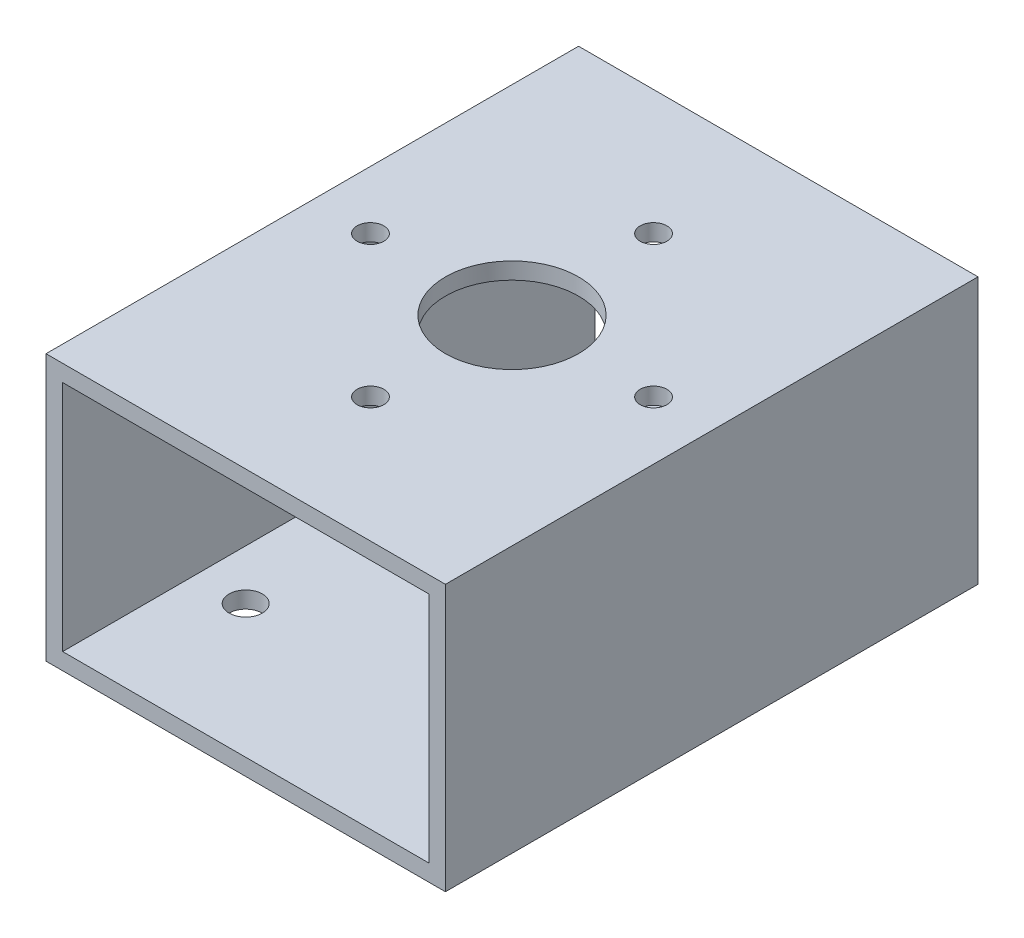
ISO-10303-21;
HEADER;
FILE_DESCRIPTION(('STEP AP214'),'2;1');
FILE_NAME('part.step','',(''),(''),'','','');
FILE_SCHEMA(('AUTOMOTIVE_DESIGN { 1 0 10303 214 1 1 1 1 }'));
ENDSEC;
DATA;
#1=APPLICATION_CONTEXT('core data for automotive mechanical design processes');
#2=APPLICATION_PROTOCOL_DEFINITION('international standard','automotive_design',2000,#1);
#3=PRODUCT_CONTEXT('',#1,'mechanical');
#4=PRODUCT('Part','Part','',(#3));
#5=PRODUCT_RELATED_PRODUCT_CATEGORY('part','',(#4));
#6=PRODUCT_DEFINITION_FORMATION('','',#4);
#7=PRODUCT_DEFINITION_CONTEXT('part definition',#1,'design');
#8=PRODUCT_DEFINITION('design','',#6,#7);
#9=PRODUCT_DEFINITION_SHAPE('','',#8);
#10=(LENGTH_UNIT() NAMED_UNIT(*) SI_UNIT(.MILLI.,.METRE.));
#11=(NAMED_UNIT(*) PLANE_ANGLE_UNIT() SI_UNIT($,.RADIAN.));
#12=(NAMED_UNIT(*) SI_UNIT($,.STERADIAN.) SOLID_ANGLE_UNIT());
#13=UNCERTAINTY_MEASURE_WITH_UNIT(LENGTH_MEASURE(1.E-05),#10,'distance_accuracy_value','');
#14=(GEOMETRIC_REPRESENTATION_CONTEXT(3) GLOBAL_UNCERTAINTY_ASSIGNED_CONTEXT((#13)) GLOBAL_UNIT_ASSIGNED_CONTEXT((#10,
#11,#12)) REPRESENTATION_CONTEXT('',''));
#15=CARTESIAN_POINT('',(0.,0.,0.));
#16=DIRECTION('',(0.,0.,1.));
#17=DIRECTION('',(1.,0.,0.));
#18=AXIS2_PLACEMENT_3D('',#15,#16,#17);
#19=CARTESIAN_POINT('',(-34.925,22.225,101.6));
#20=DIRECTION('',(0.,-1.,0.));
#21=DIRECTION('',(1.,0.,0.));
#22=AXIS2_PLACEMENT_3D('',#19,#20,#21);
#23=PLANE('',#22);
#24=CARTESIAN_POINT('',(0.,22.225,50.8));
#25=DIRECTION('',(0.,-1.,0.));
#26=DIRECTION('',(1.,0.,0.));
#27=AXIS2_PLACEMENT_3D('',#24,#25,#26);
#28=CIRCLE('',#27,12.7);
#29=CARTESIAN_POINT('',(12.7,22.225,50.8));
#30=VERTEX_POINT('',#29);
#31=EDGE_CURVE('E311',#30,#30,#28,.F.);
#32=ORIENTED_EDGE('',*,*,#31,.T.);
#33=EDGE_LOOP('',(#32));
#34=FACE_BOUND('',#33,.T.);
#35=DIRECTION('',(-1.,0.,0.));
#36=VECTOR('',#35,1.);
#37=CARTESIAN_POINT('',(-34.925,22.225,0.));
#38=LINE('',#37,#36);
#39=CARTESIAN_POINT('',(34.925,22.225,0.));
#40=VERTEX_POINT('',#39);
#41=CARTESIAN_POINT('',(-34.925,22.225,0.));
#42=VERTEX_POINT('',#41);
#43=EDGE_CURVE('E107',#40,#42,#38,.T.);
#44=ORIENTED_EDGE('',*,*,#43,.F.);
#45=DIRECTION('',(0.,0.,-1.));
#46=VECTOR('',#45,1.);
#47=CARTESIAN_POINT('',(34.925,22.225,101.6));
#48=LINE('',#47,#46);
#49=CARTESIAN_POINT('',(34.925,22.225,101.6));
#50=VERTEX_POINT('',#49);
#51=EDGE_CURVE('E48',#50,#40,#48,.T.);
#52=ORIENTED_EDGE('',*,*,#51,.F.);
#53=DIRECTION('',(-1.,0.,0.));
#54=VECTOR('',#53,1.);
#55=CARTESIAN_POINT('',(-34.925,22.225,101.6));
#56=LINE('',#55,#54);
#57=CARTESIAN_POINT('',(-34.925,22.225,101.6));
#58=VERTEX_POINT('',#57);
#59=EDGE_CURVE('E121',#50,#58,#56,.T.);
#60=ORIENTED_EDGE('',*,*,#59,.T.);
#61=DIRECTION('',(0.,0.,-1.));
#62=VECTOR('',#61,1.);
#63=CARTESIAN_POINT('',(-34.925,22.225,101.6));
#64=LINE('',#63,#62);
#65=EDGE_CURVE('E102',#58,#42,#64,.T.);
#66=ORIENTED_EDGE('',*,*,#65,.T.);
#67=EDGE_LOOP('',(#44,#52,#60,#66));
#68=FACE_BOUND('',#67,.T.);
#69=CARTESIAN_POINT('',(1.53103951828523E-12,22.225,77.8002));
#70=DIRECTION('',(0.,-1.,0.));
#71=DIRECTION('',(1.,0.,0.));
#72=AXIS2_PLACEMENT_3D('',#69,#70,#71);
#73=CIRCLE('',#72,2.5527);
#74=CARTESIAN_POINT('',(2.55270000000153,22.225,77.8002));
#75=VERTEX_POINT('',#74);
#76=EDGE_CURVE('E127',#75,#75,#73,.F.);
#77=ORIENTED_EDGE('',*,*,#76,.T.);
#78=EDGE_LOOP('',(#77));
#79=FACE_BOUND('',#78,.T.);
#80=CARTESIAN_POINT('',(27.0002000000008,22.225,50.7999999999992));
#81=DIRECTION('',(0.,-1.,0.));
#82=DIRECTION('',(1.,0.,0.));
#83=AXIS2_PLACEMENT_3D('',#80,#81,#82);
#84=CIRCLE('',#83,2.5527);
#85=CARTESIAN_POINT('',(29.5529000000008,22.225,50.7999999999992));
#86=VERTEX_POINT('',#85);
#87=EDGE_CURVE('E257',#86,#86,#84,.F.);
#88=ORIENTED_EDGE('',*,*,#87,.T.);
#89=EDGE_LOOP('',(#88));
#90=FACE_BOUND('',#89,.T.);
#91=CARTESIAN_POINT('',(0.,22.225,23.7998));
#92=DIRECTION('',(0.,-1.,0.));
#93=DIRECTION('',(1.,0.,0.));
#94=AXIS2_PLACEMENT_3D('',#91,#92,#93);
#95=CIRCLE('',#94,2.5527);
#96=CARTESIAN_POINT('',(2.5527,22.225,23.7998));
#97=VERTEX_POINT('',#96);
#98=EDGE_CURVE('E251',#97,#97,#95,.F.);
#99=ORIENTED_EDGE('',*,*,#98,.T.);
#100=EDGE_LOOP('',(#99));
#101=FACE_BOUND('',#100,.T.);
#102=CARTESIAN_POINT('',(-27.0001999999992,22.225,50.8000000000008));
#103=DIRECTION('',(0.,-1.,0.));
#104=DIRECTION('',(1.,0.,0.));
#105=AXIS2_PLACEMENT_3D('',#102,#103,#104);
#106=CIRCLE('',#105,2.5527);
#107=CARTESIAN_POINT('',(-24.4474999999992,22.225,50.8000000000008));
#108=VERTEX_POINT('',#107);
#109=EDGE_CURVE('E245',#108,#108,#106,.F.);
#110=ORIENTED_EDGE('',*,*,#109,.T.);
#111=EDGE_LOOP('',(#110));
#112=FACE_BOUND('',#111,.T.);
#113=ADVANCED_FACE('F33',(#34,#68,#79,#90,#101,#112),#23,.T.);
#114=CARTESIAN_POINT('',(0.,0.,101.6));
#115=DIRECTION('',(0.,0.,-1.));
#116=DIRECTION('',(-1.,0.,0.));
#117=AXIS2_PLACEMENT_3D('',#114,#115,#116);
#118=PLANE('',#117);
#119=DIRECTION('',(0.,1.,0.));
#120=VECTOR('',#119,1.);
#121=CARTESIAN_POINT('',(38.1,-25.4,101.6));
#122=LINE('',#121,#120);
#123=CARTESIAN_POINT('',(38.1,-25.4,101.6));
#124=VERTEX_POINT('',#123);
#125=CARTESIAN_POINT('',(38.1,25.4,101.6));
#126=VERTEX_POINT('',#125);
#127=EDGE_CURVE('E137',#124,#126,#122,.T.);
#128=ORIENTED_EDGE('',*,*,#127,.T.);
#129=DIRECTION('',(-1.,0.,0.));
#130=VECTOR('',#129,1.);
#131=CARTESIAN_POINT('',(-38.1,25.4,101.6));
#132=LINE('',#131,#130);
#133=CARTESIAN_POINT('',(-38.1,25.4,101.6));
#134=VERTEX_POINT('',#133);
#135=EDGE_CURVE('E140',#126,#134,#132,.T.);
#136=ORIENTED_EDGE('',*,*,#135,.T.);
#137=DIRECTION('',(0.,-1.,0.));
#138=VECTOR('',#137,1.);
#139=CARTESIAN_POINT('',(-38.1,-25.4,101.6));
#140=LINE('',#139,#138);
#141=CARTESIAN_POINT('',(-38.1,-25.4,101.6));
#142=VERTEX_POINT('',#141);
#143=EDGE_CURVE('E143',#134,#142,#140,.T.);
#144=ORIENTED_EDGE('',*,*,#143,.T.);
#145=DIRECTION('',(1.,0.,0.));
#146=VECTOR('',#145,1.);
#147=CARTESIAN_POINT('',(-38.1,-25.4,101.6));
#148=LINE('',#147,#146);
#149=EDGE_CURVE('E145',#142,#124,#148,.T.);
#150=ORIENTED_EDGE('',*,*,#149,.T.);
#151=EDGE_LOOP('',(#128,#136,#144,#150));
#152=FACE_BOUND('',#151,.T.);
#153=DIRECTION('',(0.,-1.,0.));
#154=VECTOR('',#153,1.);
#155=CARTESIAN_POINT('',(-34.925,-22.225,101.6));
#156=LINE('',#155,#154);
#157=CARTESIAN_POINT('',(-34.925,-22.225,101.6));
#158=VERTEX_POINT('',#157);
#159=EDGE_CURVE('E98',#58,#158,#156,.T.);
#160=ORIENTED_EDGE('',*,*,#159,.F.);
#161=ORIENTED_EDGE('',*,*,#59,.F.);
#162=DIRECTION('',(0.,1.,0.));
#163=VECTOR('',#162,1.);
#164=CARTESIAN_POINT('',(34.925,-22.225,101.6));
#165=LINE('',#164,#163);
#166=CARTESIAN_POINT('',(34.925,-22.225,101.6));
#167=VERTEX_POINT('',#166);
#168=EDGE_CURVE('E119',#167,#50,#165,.T.);
#169=ORIENTED_EDGE('',*,*,#168,.F.);
#170=DIRECTION('',(1.,0.,0.));
#171=VECTOR('',#170,1.);
#172=CARTESIAN_POINT('',(-34.925,-22.225,101.6));
#173=LINE('',#172,#171);
#174=EDGE_CURVE('E106',#158,#167,#173,.T.);
#175=ORIENTED_EDGE('',*,*,#174,.F.);
#176=EDGE_LOOP('',(#160,#161,#169,#175));
#177=FACE_BOUND('',#176,.T.);
#178=ADVANCED_FACE('F118',(#152,#177),#118,.F.);
#179=CARTESIAN_POINT('',(0.,0.,0.));
#180=DIRECTION('',(0.,0.,-1.));
#181=DIRECTION('',(-1.,0.,0.));
#182=AXIS2_PLACEMENT_3D('',#179,#180,#181);
#183=PLANE('',#182);
#184=DIRECTION('',(0.,1.,0.));
#185=VECTOR('',#184,1.);
#186=CARTESIAN_POINT('',(38.1,-25.4,0.));
#187=LINE('',#186,#185);
#188=CARTESIAN_POINT('',(38.1,-25.4,0.));
#189=VERTEX_POINT('',#188);
#190=CARTESIAN_POINT('',(38.1,25.4,0.));
#191=VERTEX_POINT('',#190);
#192=EDGE_CURVE('E114',#189,#191,#187,.T.);
#193=ORIENTED_EDGE('',*,*,#192,.F.);
#194=DIRECTION('',(1.,0.,0.));
#195=VECTOR('',#194,1.);
#196=CARTESIAN_POINT('',(-38.1,-25.4,0.));
#197=LINE('',#196,#195);
#198=CARTESIAN_POINT('',(-38.1,-25.4,0.));
#199=VERTEX_POINT('',#198);
#200=EDGE_CURVE('E141',#199,#189,#197,.T.);
#201=ORIENTED_EDGE('',*,*,#200,.F.);
#202=DIRECTION('',(0.,-1.,0.));
#203=VECTOR('',#202,1.);
#204=CARTESIAN_POINT('',(-38.1,-25.4,0.));
#205=LINE('',#204,#203);
#206=CARTESIAN_POINT('',(-38.1,25.4,0.));
#207=VERTEX_POINT('',#206);
#208=EDGE_CURVE('E152',#207,#199,#205,.T.);
#209=ORIENTED_EDGE('',*,*,#208,.F.);
#210=DIRECTION('',(-1.,0.,0.));
#211=VECTOR('',#210,1.);
#212=CARTESIAN_POINT('',(-38.1,25.4,0.));
#213=LINE('',#212,#211);
#214=EDGE_CURVE('E150',#191,#207,#213,.T.);
#215=ORIENTED_EDGE('',*,*,#214,.F.);
#216=EDGE_LOOP('',(#193,#201,#209,#215));
#217=FACE_BOUND('',#216,.T.);
#218=ORIENTED_EDGE('',*,*,#43,.T.);
#219=DIRECTION('',(0.,-1.,0.));
#220=VECTOR('',#219,1.);
#221=CARTESIAN_POINT('',(-34.925,-22.225,0.));
#222=LINE('',#221,#220);
#223=CARTESIAN_POINT('',(-34.925,-22.225,0.));
#224=VERTEX_POINT('',#223);
#225=EDGE_CURVE('E56',#42,#224,#222,.T.);
#226=ORIENTED_EDGE('',*,*,#225,.T.);
#227=DIRECTION('',(1.,0.,0.));
#228=VECTOR('',#227,1.);
#229=CARTESIAN_POINT('',(-34.925,-22.225,0.));
#230=LINE('',#229,#228);
#231=CARTESIAN_POINT('',(34.925,-22.225,0.));
#232=VERTEX_POINT('',#231);
#233=EDGE_CURVE('E113',#224,#232,#230,.T.);
#234=ORIENTED_EDGE('',*,*,#233,.T.);
#235=DIRECTION('',(0.,1.,0.));
#236=VECTOR('',#235,1.);
#237=CARTESIAN_POINT('',(34.925,-22.225,0.));
#238=LINE('',#237,#236);
#239=EDGE_CURVE('E129',#232,#40,#238,.T.);
#240=ORIENTED_EDGE('',*,*,#239,.T.);
#241=EDGE_LOOP('',(#218,#226,#234,#240));
#242=FACE_BOUND('',#241,.T.);
#243=ADVANCED_FACE('F170',(#217,#242),#183,.T.);
#244=CARTESIAN_POINT('',(38.1,-25.4,101.6));
#245=DIRECTION('',(-1.,0.,0.));
#246=DIRECTION('',(0.,0.,1.));
#247=AXIS2_PLACEMENT_3D('',#244,#245,#246);
#248=PLANE('',#247);
#249=ORIENTED_EDGE('',*,*,#192,.T.);
#250=DIRECTION('',(0.,0.,-1.));
#251=VECTOR('',#250,1.);
#252=CARTESIAN_POINT('',(38.1,25.4,101.6));
#253=LINE('',#252,#251);
#254=EDGE_CURVE('E11',#126,#191,#253,.T.);
#255=ORIENTED_EDGE('',*,*,#254,.F.);
#256=ORIENTED_EDGE('',*,*,#127,.F.);
#257=DIRECTION('',(0.,0.,-1.));
#258=VECTOR('',#257,1.);
#259=CARTESIAN_POINT('',(38.1,-25.4,101.6));
#260=LINE('',#259,#258);
#261=EDGE_CURVE('E147',#124,#189,#260,.T.);
#262=ORIENTED_EDGE('',*,*,#261,.T.);
#263=EDGE_LOOP('',(#249,#255,#256,#262));
#264=FACE_BOUND('',#263,.T.);
#265=ADVANCED_FACE('F35',(#264),#248,.F.);
#266=CARTESIAN_POINT('',(-38.1,25.4,101.6));
#267=DIRECTION('',(0.,-1.,0.));
#268=DIRECTION('',(0.,0.,-1.));
#269=AXIS2_PLACEMENT_3D('',#266,#267,#268);
#270=PLANE('',#269);
#271=CARTESIAN_POINT('',(0.,25.4,50.8));
#272=DIRECTION('',(0.,1.,0.));
#273=DIRECTION('',(0.,0.,1.));
#274=AXIS2_PLACEMENT_3D('',#271,#272,#273);
#275=CIRCLE('',#274,12.7);
#276=CARTESIAN_POINT('',(0.,25.4,63.5));
#277=VERTEX_POINT('',#276);
#278=EDGE_CURVE('E313',#277,#277,#275,.T.);
#279=ORIENTED_EDGE('',*,*,#278,.F.);
#280=EDGE_LOOP('',(#279));
#281=FACE_BOUND('',#280,.T.);
#282=CARTESIAN_POINT('',(-27.0001999999992,25.4,50.8000000000008));
#283=DIRECTION('',(0.,1.,0.));
#284=DIRECTION('',(0.,0.,1.));
#285=AXIS2_PLACEMENT_3D('',#282,#283,#284);
#286=CIRCLE('',#285,2.5527);
#287=CARTESIAN_POINT('',(-27.0001999999992,25.4,53.3527000000008));
#288=VERTEX_POINT('',#287);
#289=EDGE_CURVE('E237',#288,#288,#286,.T.);
#290=ORIENTED_EDGE('',*,*,#289,.F.);
#291=EDGE_LOOP('',(#290));
#292=FACE_BOUND('',#291,.T.);
#293=CARTESIAN_POINT('',(0.,25.4,23.7998));
#294=DIRECTION('',(0.,1.,0.));
#295=DIRECTION('',(0.,0.,1.));
#296=AXIS2_PLACEMENT_3D('',#293,#294,#295);
#297=CIRCLE('',#296,2.5527);
#298=CARTESIAN_POINT('',(0.,25.4,26.3525));
#299=VERTEX_POINT('',#298);
#300=EDGE_CURVE('E248',#299,#299,#297,.T.);
#301=ORIENTED_EDGE('',*,*,#300,.F.);
#302=EDGE_LOOP('',(#301));
#303=FACE_BOUND('',#302,.T.);
#304=CARTESIAN_POINT('',(27.0002000000008,25.4,50.7999999999992));
#305=DIRECTION('',(0.,1.,0.));
#306=DIRECTION('',(0.,0.,1.));
#307=AXIS2_PLACEMENT_3D('',#304,#305,#306);
#308=CIRCLE('',#307,2.5527);
#309=CARTESIAN_POINT('',(27.0002000000008,25.4,53.3526999999992));
#310=VERTEX_POINT('',#309);
#311=EDGE_CURVE('E254',#310,#310,#308,.T.);
#312=ORIENTED_EDGE('',*,*,#311,.F.);
#313=EDGE_LOOP('',(#312));
#314=FACE_BOUND('',#313,.T.);
#315=CARTESIAN_POINT('',(1.53103951828523E-12,25.4,77.8002));
#316=DIRECTION('',(0.,1.,0.));
#317=DIRECTION('',(0.,0.,1.));
#318=AXIS2_PLACEMENT_3D('',#315,#316,#317);
#319=CIRCLE('',#318,2.5527);
#320=CARTESIAN_POINT('',(1.53103951828523E-12,25.4,80.3529));
#321=VERTEX_POINT('',#320);
#322=EDGE_CURVE('E260',#321,#321,#319,.T.);
#323=ORIENTED_EDGE('',*,*,#322,.F.);
#324=EDGE_LOOP('',(#323));
#325=FACE_BOUND('',#324,.T.);
#326=ORIENTED_EDGE('',*,*,#214,.T.);
#327=DIRECTION('',(0.,0.,-1.));
#328=VECTOR('',#327,1.);
#329=CARTESIAN_POINT('',(-38.1,25.4,101.6));
#330=LINE('',#329,#328);
#331=EDGE_CURVE('E41',#134,#207,#330,.T.);
#332=ORIENTED_EDGE('',*,*,#331,.F.);
#333=ORIENTED_EDGE('',*,*,#135,.F.);
#334=ORIENTED_EDGE('',*,*,#254,.T.);
#335=EDGE_LOOP('',(#326,#332,#333,#334));
#336=FACE_BOUND('',#335,.T.);
#337=ADVANCED_FACE('F180',(#281,#292,#303,#314,#325,#336),#270,.F.);
#338=CARTESIAN_POINT('',(-38.1,-25.4,101.6));
#339=DIRECTION('',(1.,0.,0.));
#340=DIRECTION('',(0.,0.,-1.));
#341=AXIS2_PLACEMENT_3D('',#338,#339,#340);
#342=PLANE('',#341);
#343=ORIENTED_EDGE('',*,*,#208,.T.);
#344=DIRECTION('',(0.,0.,-1.));
#345=VECTOR('',#344,1.);
#346=CARTESIAN_POINT('',(-38.1,-25.4,101.6));
#347=LINE('',#346,#345);
#348=EDGE_CURVE('E157',#142,#199,#347,.T.);
#349=ORIENTED_EDGE('',*,*,#348,.F.);
#350=ORIENTED_EDGE('',*,*,#143,.F.);
#351=ORIENTED_EDGE('',*,*,#331,.T.);
#352=EDGE_LOOP('',(#343,#349,#350,#351));
#353=FACE_BOUND('',#352,.T.);
#354=ADVANCED_FACE('F164',(#353),#342,.F.);
#355=CARTESIAN_POINT('',(-38.1,-25.4,101.6));
#356=DIRECTION('',(0.,1.,0.));
#357=DIRECTION('',(0.,0.,1.));
#358=AXIS2_PLACEMENT_3D('',#355,#356,#357);
#359=PLANE('',#358);
#360=CARTESIAN_POINT('',(-25.4,-25.4,25.4));
#361=DIRECTION('',(0.,-1.,0.));
#362=DIRECTION('',(0.,0.,-1.));
#363=AXIS2_PLACEMENT_3D('',#360,#361,#362);
#364=CIRCLE('',#363,3.17499999999999);
#365=CARTESIAN_POINT('',(-25.4,-25.4,22.225));
#366=VERTEX_POINT('',#365);
#367=EDGE_CURVE('E220',#366,#366,#364,.T.);
#368=ORIENTED_EDGE('',*,*,#367,.F.);
#369=EDGE_LOOP('',(#368));
#370=FACE_BOUND('',#369,.T.);
#371=CARTESIAN_POINT('',(-25.4,-25.4,76.2));
#372=DIRECTION('',(0.,-1.,0.));
#373=DIRECTION('',(0.,0.,-1.));
#374=AXIS2_PLACEMENT_3D('',#371,#372,#373);
#375=CIRCLE('',#374,3.17499999999999);
#376=CARTESIAN_POINT('',(-25.4,-25.4,73.025));
#377=VERTEX_POINT('',#376);
#378=EDGE_CURVE('E224',#377,#377,#375,.T.);
#379=ORIENTED_EDGE('',*,*,#378,.F.);
#380=EDGE_LOOP('',(#379));
#381=FACE_BOUND('',#380,.T.);
#382=CARTESIAN_POINT('',(25.4,-25.4,76.2));
#383=DIRECTION('',(0.,-1.,0.));
#384=DIRECTION('',(0.,0.,-1.));
#385=AXIS2_PLACEMENT_3D('',#382,#383,#384);
#386=CIRCLE('',#385,3.17499999999999);
#387=CARTESIAN_POINT('',(25.4,-25.4,73.025));
#388=VERTEX_POINT('',#387);
#389=EDGE_CURVE('E228',#388,#388,#386,.T.);
#390=ORIENTED_EDGE('',*,*,#389,.F.);
#391=EDGE_LOOP('',(#390));
#392=FACE_BOUND('',#391,.T.);
#393=CARTESIAN_POINT('',(25.4,-25.4,25.4));
#394=DIRECTION('',(0.,-1.,0.));
#395=DIRECTION('',(0.,0.,-1.));
#396=AXIS2_PLACEMENT_3D('',#393,#394,#395);
#397=CIRCLE('',#396,3.17499999999999);
#398=CARTESIAN_POINT('',(25.4,-25.4,22.225));
#399=VERTEX_POINT('',#398);
#400=EDGE_CURVE('E231',#399,#399,#397,.T.);
#401=ORIENTED_EDGE('',*,*,#400,.F.);
#402=EDGE_LOOP('',(#401));
#403=FACE_BOUND('',#402,.T.);
#404=ORIENTED_EDGE('',*,*,#200,.T.);
#405=ORIENTED_EDGE('',*,*,#261,.F.);
#406=ORIENTED_EDGE('',*,*,#149,.F.);
#407=ORIENTED_EDGE('',*,*,#348,.T.);
#408=EDGE_LOOP('',(#404,#405,#406,#407));
#409=FACE_BOUND('',#408,.T.);
#410=ADVANCED_FACE('F174',(#370,#381,#392,#403,#409),#359,.F.);
#411=CARTESIAN_POINT('',(-34.925,-22.225,101.6));
#412=DIRECTION('',(1.,0.,0.));
#413=DIRECTION('',(0.,0.,-1.));
#414=AXIS2_PLACEMENT_3D('',#411,#412,#413);
#415=PLANE('',#414);
#416=ORIENTED_EDGE('',*,*,#225,.F.);
#417=ORIENTED_EDGE('',*,*,#65,.F.);
#418=ORIENTED_EDGE('',*,*,#159,.T.);
#419=DIRECTION('',(0.,0.,-1.));
#420=VECTOR('',#419,1.);
#421=CARTESIAN_POINT('',(-34.925,-22.225,101.6));
#422=LINE('',#421,#420);
#423=EDGE_CURVE('E101',#158,#224,#422,.T.);
#424=ORIENTED_EDGE('',*,*,#423,.T.);
#425=EDGE_LOOP('',(#416,#417,#418,#424));
#426=FACE_BOUND('',#425,.T.);
#427=ADVANCED_FACE('F100',(#426),#415,.T.);
#428=CARTESIAN_POINT('',(-34.925,-22.225,101.6));
#429=DIRECTION('',(0.,1.,0.));
#430=DIRECTION('',(0.,0.,1.));
#431=AXIS2_PLACEMENT_3D('',#428,#429,#430);
#432=PLANE('',#431);
#433=CARTESIAN_POINT('',(-25.4,-22.225,25.4));
#434=DIRECTION('',(0.,1.,0.));
#435=DIRECTION('',(0.,0.,1.));
#436=AXIS2_PLACEMENT_3D('',#433,#434,#435);
#437=CIRCLE('',#436,3.175);
#438=CARTESIAN_POINT('',(-25.4,-22.225,28.575));
#439=VERTEX_POINT('',#438);
#440=EDGE_CURVE('E315',#439,#439,#437,.T.);
#441=ORIENTED_EDGE('',*,*,#440,.F.);
#442=EDGE_LOOP('',(#441));
#443=FACE_BOUND('',#442,.T.);
#444=CARTESIAN_POINT('',(-25.4,-22.225,76.2));
#445=DIRECTION('',(0.,1.,0.));
#446=DIRECTION('',(0.,0.,1.));
#447=AXIS2_PLACEMENT_3D('',#444,#445,#446);
#448=CIRCLE('',#447,3.175);
#449=CARTESIAN_POINT('',(-25.4,-22.225,79.375));
#450=VERTEX_POINT('',#449);
#451=EDGE_CURVE('E322',#450,#450,#448,.T.);
#452=ORIENTED_EDGE('',*,*,#451,.F.);
#453=EDGE_LOOP('',(#452));
#454=FACE_BOUND('',#453,.T.);
#455=CARTESIAN_POINT('',(25.4,-22.225,76.2));
#456=DIRECTION('',(0.,1.,0.));
#457=DIRECTION('',(0.,0.,1.));
#458=AXIS2_PLACEMENT_3D('',#455,#456,#457);
#459=CIRCLE('',#458,3.175);
#460=CARTESIAN_POINT('',(25.4,-22.225,79.375));
#461=VERTEX_POINT('',#460);
#462=EDGE_CURVE('E234',#461,#461,#459,.T.);
#463=ORIENTED_EDGE('',*,*,#462,.F.);
#464=EDGE_LOOP('',(#463));
#465=FACE_BOUND('',#464,.T.);
#466=CARTESIAN_POINT('',(25.4,-22.225,25.4));
#467=DIRECTION('',(0.,1.,0.));
#468=DIRECTION('',(0.,0.,1.));
#469=AXIS2_PLACEMENT_3D('',#466,#467,#468);
#470=CIRCLE('',#469,3.175);
#471=CARTESIAN_POINT('',(25.4,-22.225,28.575));
#472=VERTEX_POINT('',#471);
#473=EDGE_CURVE('E233',#472,#472,#470,.T.);
#474=ORIENTED_EDGE('',*,*,#473,.F.);
#475=EDGE_LOOP('',(#474));
#476=FACE_BOUND('',#475,.T.);
#477=ORIENTED_EDGE('',*,*,#233,.F.);
#478=ORIENTED_EDGE('',*,*,#423,.F.);
#479=ORIENTED_EDGE('',*,*,#174,.T.);
#480=DIRECTION('',(0.,0.,-1.));
#481=VECTOR('',#480,1.);
#482=CARTESIAN_POINT('',(34.925,-22.225,101.6));
#483=LINE('',#482,#481);
#484=EDGE_CURVE('E115',#167,#232,#483,.T.);
#485=ORIENTED_EDGE('',*,*,#484,.T.);
#486=EDGE_LOOP('',(#477,#478,#479,#485));
#487=FACE_BOUND('',#486,.T.);
#488=ADVANCED_FACE('F110',(#443,#454,#465,#476,#487),#432,.T.);
#489=CARTESIAN_POINT('',(34.925,-22.225,101.6));
#490=DIRECTION('',(-1.,0.,0.));
#491=DIRECTION('',(0.,0.,1.));
#492=AXIS2_PLACEMENT_3D('',#489,#490,#491);
#493=PLANE('',#492);
#494=ORIENTED_EDGE('',*,*,#239,.F.);
#495=ORIENTED_EDGE('',*,*,#484,.F.);
#496=ORIENTED_EDGE('',*,*,#168,.T.);
#497=ORIENTED_EDGE('',*,*,#51,.T.);
#498=EDGE_LOOP('',(#494,#495,#496,#497));
#499=FACE_BOUND('',#498,.T.);
#500=ADVANCED_FACE('F202',(#499),#493,.T.);
#501=CARTESIAN_POINT('',(1.53103951828523E-12,25.4,77.8002));
#502=DIRECTION('',(0.,1.,0.));
#503=DIRECTION('',(0.,0.,1.));
#504=AXIS2_PLACEMENT_3D('',#501,#502,#503);
#505=CYLINDRICAL_SURFACE('',#504,2.5527);
#506=ORIENTED_EDGE('',*,*,#76,.F.);
#507=EDGE_LOOP('',(#506));
#508=FACE_BOUND('',#507,.T.);
#509=ORIENTED_EDGE('',*,*,#322,.T.);
#510=EDGE_LOOP('',(#509));
#511=FACE_BOUND('',#510,.T.);
#512=ADVANCED_FACE('F200',(#508,#511),#505,.F.);
#513=CARTESIAN_POINT('',(27.0002000000008,25.4,50.7999999999992));
#514=DIRECTION('',(0.,1.,0.));
#515=DIRECTION('',(0.,0.,1.));
#516=AXIS2_PLACEMENT_3D('',#513,#514,#515);
#517=CYLINDRICAL_SURFACE('',#516,2.5527);
#518=ORIENTED_EDGE('',*,*,#87,.F.);
#519=EDGE_LOOP('',(#518));
#520=FACE_BOUND('',#519,.T.);
#521=ORIENTED_EDGE('',*,*,#311,.T.);
#522=EDGE_LOOP('',(#521));
#523=FACE_BOUND('',#522,.T.);
#524=ADVANCED_FACE('F269',(#520,#523),#517,.F.);
#525=CARTESIAN_POINT('',(0.,25.4,23.7998));
#526=DIRECTION('',(0.,1.,0.));
#527=DIRECTION('',(0.,0.,1.));
#528=AXIS2_PLACEMENT_3D('',#525,#526,#527);
#529=CYLINDRICAL_SURFACE('',#528,2.5527);
#530=ORIENTED_EDGE('',*,*,#98,.F.);
#531=EDGE_LOOP('',(#530));
#532=FACE_BOUND('',#531,.T.);
#533=ORIENTED_EDGE('',*,*,#300,.T.);
#534=EDGE_LOOP('',(#533));
#535=FACE_BOUND('',#534,.T.);
#536=ADVANCED_FACE('F275',(#532,#535),#529,.F.);
#537=CARTESIAN_POINT('',(-27.0001999999992,25.4,50.8000000000008));
#538=DIRECTION('',(0.,1.,0.));
#539=DIRECTION('',(0.,0.,1.));
#540=AXIS2_PLACEMENT_3D('',#537,#538,#539);
#541=CYLINDRICAL_SURFACE('',#540,2.5527);
#542=ORIENTED_EDGE('',*,*,#109,.F.);
#543=EDGE_LOOP('',(#542));
#544=FACE_BOUND('',#543,.T.);
#545=ORIENTED_EDGE('',*,*,#289,.T.);
#546=EDGE_LOOP('',(#545));
#547=FACE_BOUND('',#546,.T.);
#548=ADVANCED_FACE('F280',(#544,#547),#541,.F.);
#549=CARTESIAN_POINT('',(25.4,-25.4,25.4));
#550=DIRECTION('',(0.,-1.,0.));
#551=DIRECTION('',(0.,0.,-1.));
#552=AXIS2_PLACEMENT_3D('',#549,#550,#551);
#553=CYLINDRICAL_SURFACE('',#552,3.175);
#554=ORIENTED_EDGE('',*,*,#400,.T.);
#555=EDGE_LOOP('',(#554));
#556=FACE_BOUND('',#555,.T.);
#557=ORIENTED_EDGE('',*,*,#473,.T.);
#558=EDGE_LOOP('',(#557));
#559=FACE_BOUND('',#558,.T.);
#560=ADVANCED_FACE('F288',(#556,#559),#553,.F.);
#561=CARTESIAN_POINT('',(25.4,-25.4,76.2));
#562=DIRECTION('',(0.,-1.,0.));
#563=DIRECTION('',(0.,0.,-1.));
#564=AXIS2_PLACEMENT_3D('',#561,#562,#563);
#565=CYLINDRICAL_SURFACE('',#564,3.175);
#566=ORIENTED_EDGE('',*,*,#389,.T.);
#567=EDGE_LOOP('',(#566));
#568=FACE_BOUND('',#567,.T.);
#569=ORIENTED_EDGE('',*,*,#462,.T.);
#570=EDGE_LOOP('',(#569));
#571=FACE_BOUND('',#570,.T.);
#572=ADVANCED_FACE('F292',(#568,#571),#565,.F.);
#573=CARTESIAN_POINT('',(-25.4,-25.4,76.2));
#574=DIRECTION('',(0.,-1.,0.));
#575=DIRECTION('',(0.,0.,-1.));
#576=AXIS2_PLACEMENT_3D('',#573,#574,#575);
#577=CYLINDRICAL_SURFACE('',#576,3.175);
#578=ORIENTED_EDGE('',*,*,#378,.T.);
#579=EDGE_LOOP('',(#578));
#580=FACE_BOUND('',#579,.T.);
#581=ORIENTED_EDGE('',*,*,#451,.T.);
#582=EDGE_LOOP('',(#581));
#583=FACE_BOUND('',#582,.T.);
#584=ADVANCED_FACE('F295',(#580,#583),#577,.F.);
#585=CARTESIAN_POINT('',(-25.4,-25.4,25.4));
#586=DIRECTION('',(0.,-1.,0.));
#587=DIRECTION('',(0.,0.,-1.));
#588=AXIS2_PLACEMENT_3D('',#585,#586,#587);
#589=CYLINDRICAL_SURFACE('',#588,3.175);
#590=ORIENTED_EDGE('',*,*,#367,.T.);
#591=EDGE_LOOP('',(#590));
#592=FACE_BOUND('',#591,.T.);
#593=ORIENTED_EDGE('',*,*,#440,.T.);
#594=EDGE_LOOP('',(#593));
#595=FACE_BOUND('',#594,.T.);
#596=ADVANCED_FACE('F299',(#592,#595),#589,.F.);
#597=CARTESIAN_POINT('',(0.,-25.401,50.8));
#598=DIRECTION('',(0.,1.,0.));
#599=DIRECTION('',(0.,0.,1.));
#600=AXIS2_PLACEMENT_3D('',#597,#598,#599);
#601=CYLINDRICAL_SURFACE('',#600,12.7);
#602=ORIENTED_EDGE('',*,*,#31,.F.);
#603=EDGE_LOOP('',(#602));
#604=FACE_BOUND('',#603,.T.);
#605=ORIENTED_EDGE('',*,*,#278,.T.);
#606=EDGE_LOOP('',(#605));
#607=FACE_BOUND('',#606,.T.);
#608=ADVANCED_FACE('F303',(#604,#607),#601,.F.);
#609=CLOSED_SHELL('',(#113,#178,#243,#265,#337,#354,#410,#427,#488,#500,#512,#524,#536,#548,
#560,#572,#584,#596,#608));
#610=MANIFOLD_SOLID_BREP('B2',#609);
#611=ADVANCED_BREP_SHAPE_REPRESENTATION('',(#18,#610),#14);
#612=SHAPE_DEFINITION_REPRESENTATION(#9,#611);
ENDSEC;
END-ISO-10303-21;
